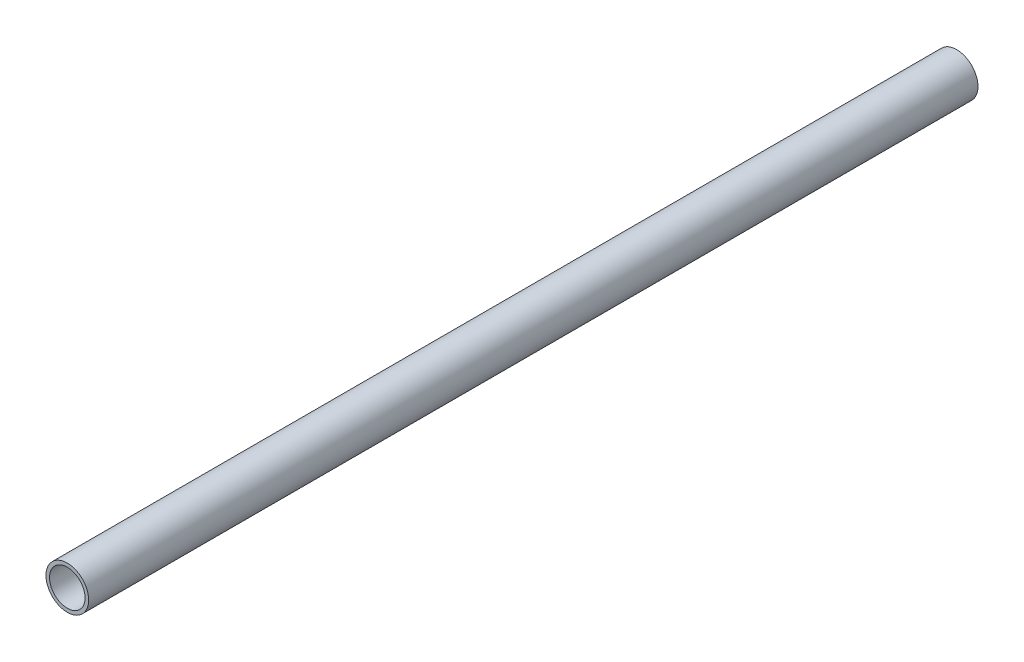
ISO-10303-21;
HEADER;
FILE_DESCRIPTION(('STEP AP214'),'2;1');
FILE_NAME('part.step','',(''),(''),'','','');
FILE_SCHEMA(('AUTOMOTIVE_DESIGN { 1 0 10303 214 1 1 1 1 }'));
ENDSEC;
DATA;
#1=APPLICATION_CONTEXT('core data for automotive mechanical design processes');
#2=APPLICATION_PROTOCOL_DEFINITION('international standard','automotive_design',2000,#1);
#3=PRODUCT_CONTEXT('',#1,'mechanical');
#4=PRODUCT('Part','Part','',(#3));
#5=PRODUCT_RELATED_PRODUCT_CATEGORY('part','',(#4));
#6=PRODUCT_DEFINITION_FORMATION('','',#4);
#7=PRODUCT_DEFINITION_CONTEXT('part definition',#1,'design');
#8=PRODUCT_DEFINITION('design','',#6,#7);
#9=PRODUCT_DEFINITION_SHAPE('','',#8);
#10=(LENGTH_UNIT() NAMED_UNIT(*) SI_UNIT(.MILLI.,.METRE.));
#11=(NAMED_UNIT(*) PLANE_ANGLE_UNIT() SI_UNIT($,.RADIAN.));
#12=(NAMED_UNIT(*) SI_UNIT($,.STERADIAN.) SOLID_ANGLE_UNIT());
#13=UNCERTAINTY_MEASURE_WITH_UNIT(LENGTH_MEASURE(1.E-05),#10,'distance_accuracy_value','');
#14=(GEOMETRIC_REPRESENTATION_CONTEXT(3) GLOBAL_UNCERTAINTY_ASSIGNED_CONTEXT((#13)) GLOBAL_UNIT_ASSIGNED_CONTEXT((#10,
#11,#12)) REPRESENTATION_CONTEXT('',''));
#15=CARTESIAN_POINT('',(0.,0.,0.));
#16=DIRECTION('',(0.,0.,1.));
#17=DIRECTION('',(1.,0.,0.));
#18=AXIS2_PLACEMENT_3D('',#15,#16,#17);
#19=CARTESIAN_POINT('',(0.,0.,250.));
#20=DIRECTION('',(0.,0.,1.));
#21=DIRECTION('',(1.,0.,0.));
#22=AXIS2_PLACEMENT_3D('',#19,#20,#21);
#23=PLANE('',#22);
#24=CARTESIAN_POINT('',(0.,0.,250.));
#25=DIRECTION('',(0.,0.,1.));
#26=DIRECTION('',(1.,0.,0.));
#27=AXIS2_PLACEMENT_3D('',#24,#25,#26);
#28=CIRCLE('',#27,6.);
#29=CARTESIAN_POINT('',(6.,0.,250.));
#30=VERTEX_POINT('',#29);
#31=EDGE_CURVE('E10',#30,#30,#28,.T.);
#32=ORIENTED_EDGE('',*,*,#31,.T.);
#33=EDGE_LOOP('',(#32));
#34=FACE_BOUND('',#33,.T.);
#35=CARTESIAN_POINT('',(0.,0.,250.));
#36=DIRECTION('',(0.,0.,1.));
#37=DIRECTION('',(1.,0.,0.));
#38=AXIS2_PLACEMENT_3D('',#35,#36,#37);
#39=CIRCLE('',#38,5.);
#40=CARTESIAN_POINT('',(5.,0.,250.));
#41=VERTEX_POINT('',#40);
#42=EDGE_CURVE('E42',#41,#41,#39,.T.);
#43=ORIENTED_EDGE('',*,*,#42,.F.);
#44=EDGE_LOOP('',(#43));
#45=FACE_BOUND('',#44,.T.);
#46=ADVANCED_FACE('F31',(#34,#45),#23,.T.);
#47=CARTESIAN_POINT('',(0.,0.,0.));
#48=DIRECTION('',(0.,0.,1.));
#49=DIRECTION('',(1.,0.,0.));
#50=AXIS2_PLACEMENT_3D('',#47,#48,#49);
#51=PLANE('',#50);
#52=CARTESIAN_POINT('',(0.,0.,0.));
#53=DIRECTION('',(0.,0.,1.));
#54=DIRECTION('',(1.,0.,0.));
#55=AXIS2_PLACEMENT_3D('',#52,#53,#54);
#56=CIRCLE('',#55,6.);
#57=CARTESIAN_POINT('',(6.,0.,0.));
#58=VERTEX_POINT('',#57);
#59=EDGE_CURVE('E35',#58,#58,#56,.T.);
#60=ORIENTED_EDGE('',*,*,#59,.F.);
#61=EDGE_LOOP('',(#60));
#62=FACE_BOUND('',#61,.T.);
#63=CARTESIAN_POINT('',(0.,0.,0.));
#64=DIRECTION('',(0.,0.,1.));
#65=DIRECTION('',(1.,0.,0.));
#66=AXIS2_PLACEMENT_3D('',#63,#64,#65);
#67=CIRCLE('',#66,5.);
#68=CARTESIAN_POINT('',(5.,0.,0.));
#69=VERTEX_POINT('',#68);
#70=EDGE_CURVE('E44',#69,#69,#67,.T.);
#71=ORIENTED_EDGE('',*,*,#70,.T.);
#72=EDGE_LOOP('',(#71));
#73=FACE_BOUND('',#72,.T.);
#74=ADVANCED_FACE('F54',(#62,#73),#51,.F.);
#75=CARTESIAN_POINT('',(0.,0.,250.));
#76=DIRECTION('',(0.,0.,-1.));
#77=DIRECTION('',(-1.,0.,0.));
#78=AXIS2_PLACEMENT_3D('',#75,#76,#77);
#79=CYLINDRICAL_SURFACE('',#78,6.);
#80=ORIENTED_EDGE('',*,*,#31,.F.);
#81=EDGE_LOOP('',(#80));
#82=FACE_BOUND('',#81,.T.);
#83=ORIENTED_EDGE('',*,*,#59,.T.);
#84=EDGE_LOOP('',(#83));
#85=FACE_BOUND('',#84,.T.);
#86=ADVANCED_FACE('F33',(#82,#85),#79,.T.);
#87=CARTESIAN_POINT('',(0.,0.,250.));
#88=DIRECTION('',(0.,0.,-1.));
#89=DIRECTION('',(-1.,0.,0.));
#90=AXIS2_PLACEMENT_3D('',#87,#88,#89);
#91=CYLINDRICAL_SURFACE('',#90,5.);
#92=ORIENTED_EDGE('',*,*,#42,.T.);
#93=EDGE_LOOP('',(#92));
#94=FACE_BOUND('',#93,.T.);
#95=ORIENTED_EDGE('',*,*,#70,.F.);
#96=EDGE_LOOP('',(#95));
#97=FACE_BOUND('',#96,.T.);
#98=ADVANCED_FACE('F50',(#94,#97),#91,.F.);
#99=CLOSED_SHELL('',(#46,#74,#86,#98));
#100=MANIFOLD_SOLID_BREP('B2',#99);
#101=ADVANCED_BREP_SHAPE_REPRESENTATION('',(#18,#100),#14);
#102=SHAPE_DEFINITION_REPRESENTATION(#9,#101);
ENDSEC;
END-ISO-10303-21;
